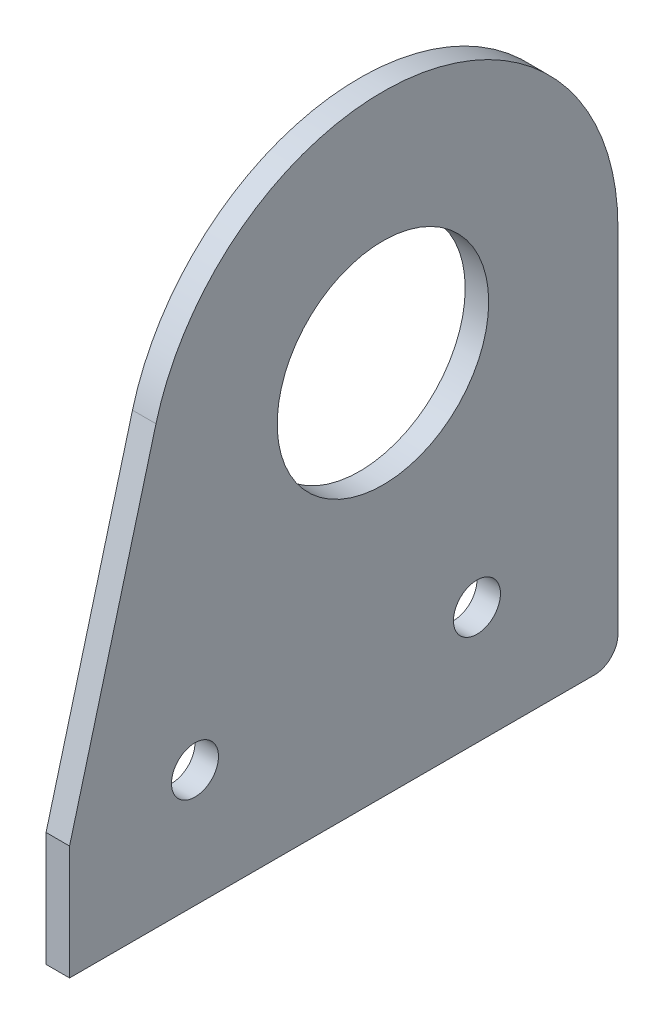
ISO-10303-21;
HEADER;
FILE_DESCRIPTION(('STEP AP214'),'2;1');
FILE_NAME('part.step','',(''),(''),'','','');
FILE_SCHEMA(('AUTOMOTIVE_DESIGN { 1 0 10303 214 1 1 1 1 }'));
ENDSEC;
DATA;
#1=APPLICATION_CONTEXT('core data for automotive mechanical design processes');
#2=APPLICATION_PROTOCOL_DEFINITION('international standard','automotive_design',2000,#1);
#3=PRODUCT_CONTEXT('',#1,'mechanical');
#4=PRODUCT('Part','Part','',(#3));
#5=PRODUCT_RELATED_PRODUCT_CATEGORY('part','',(#4));
#6=PRODUCT_DEFINITION_FORMATION('','',#4);
#7=PRODUCT_DEFINITION_CONTEXT('part definition',#1,'design');
#8=PRODUCT_DEFINITION('design','',#6,#7);
#9=PRODUCT_DEFINITION_SHAPE('','',#8);
#10=(LENGTH_UNIT() NAMED_UNIT(*) SI_UNIT(.MILLI.,.METRE.));
#11=(NAMED_UNIT(*) PLANE_ANGLE_UNIT() SI_UNIT($,.RADIAN.));
#12=(NAMED_UNIT(*) SI_UNIT($,.STERADIAN.) SOLID_ANGLE_UNIT());
#13=UNCERTAINTY_MEASURE_WITH_UNIT(LENGTH_MEASURE(1.E-05),#10,'distance_accuracy_value','');
#14=(GEOMETRIC_REPRESENTATION_CONTEXT(3) GLOBAL_UNCERTAINTY_ASSIGNED_CONTEXT((#13)) GLOBAL_UNIT_ASSIGNED_CONTEXT((#10,
#11,#12)) REPRESENTATION_CONTEXT('',''));
#15=CARTESIAN_POINT('',(0.,0.,0.));
#16=DIRECTION('',(0.,0.,1.));
#17=DIRECTION('',(1.,0.,0.));
#18=AXIS2_PLACEMENT_3D('',#15,#16,#17);
#19=CARTESIAN_POINT('',(3.175,146.05,0.));
#20=DIRECTION('',(1.,0.,0.));
#21=DIRECTION('',(0.,0.,-1.));
#22=AXIS2_PLACEMENT_3D('',#19,#20,#21);
#23=PLANE('',#22);
#24=CARTESIAN_POINT('',(3.175,111.125,25.4));
#25=DIRECTION('',(1.,0.,0.));
#26=DIRECTION('',(0.,0.,-1.));
#27=AXIS2_PLACEMENT_3D('',#24,#25,#26);
#28=CIRCLE('',#27,3.175);
#29=CARTESIAN_POINT('',(3.175,111.125,22.225));
#30=VERTEX_POINT('',#29);
#31=EDGE_CURVE('E181',#30,#30,#28,.T.);
#32=ORIENTED_EDGE('',*,*,#31,.F.);
#33=EDGE_LOOP('',(#32));
#34=FACE_BOUND('',#33,.T.);
#35=CARTESIAN_POINT('',(3.175,146.05,0.));
#36=DIRECTION('',(1.,0.,0.));
#37=DIRECTION('',(0.,0.,-1.));
#38=AXIS2_PLACEMENT_3D('',#35,#36,#37);
#39=CIRCLE('',#38,31.75);
#40=CARTESIAN_POINT('',(3.175,146.05,-31.75));
#41=VERTEX_POINT('',#40);
#42=CARTESIAN_POINT('',(3.175,154.267504682005,30.6681449846779));
#43=VERTEX_POINT('',#42);
#44=EDGE_CURVE('E154',#41,#43,#39,.T.);
#45=ORIENTED_EDGE('',*,*,#44,.T.);
#46=DIRECTION('',(0.,-0.965925826289067,0.258819045102525));
#47=VECTOR('',#46,1.);
#48=CARTESIAN_POINT('',(3.175,154.267504682005,30.6681449846779));
#49=LINE('',#48,#47);
#50=CARTESIAN_POINT('',(3.175,110.692257993871,42.3440971447506));
#51=VERTEX_POINT('',#50);
#52=EDGE_CURVE('E98',#43,#51,#49,.T.);
#53=ORIENTED_EDGE('',*,*,#52,.T.);
#54=DIRECTION('',(0.,-1.,0.));
#55=VECTOR('',#54,1.);
#56=CARTESIAN_POINT('',(3.175,95.25,42.3440971447506));
#57=LINE('',#56,#55);
#58=CARTESIAN_POINT('',(3.175,95.25,42.3440971447506));
#59=VERTEX_POINT('',#58);
#60=EDGE_CURVE('E112',#51,#59,#57,.T.);
#61=ORIENTED_EDGE('',*,*,#60,.T.);
#62=DIRECTION('',(0.,0.,-1.));
#63=VECTOR('',#62,1.);
#64=CARTESIAN_POINT('',(3.175,95.25,42.3440971447506));
#65=LINE('',#64,#63);
#66=CARTESIAN_POINT('',(3.175,95.25,-28.575));
#67=VERTEX_POINT('',#66);
#68=EDGE_CURVE('E105',#59,#67,#65,.T.);
#69=ORIENTED_EDGE('',*,*,#68,.T.);
#70=CARTESIAN_POINT('',(3.175,98.425,-28.575));
#71=DIRECTION('',(1.,0.,0.));
#72=DIRECTION('',(0.,0.,-1.));
#73=AXIS2_PLACEMENT_3D('',#70,#71,#72);
#74=CIRCLE('',#73,3.175);
#75=CARTESIAN_POINT('',(3.175,98.425,-31.75));
#76=VERTEX_POINT('',#75);
#77=EDGE_CURVE('E109',#67,#76,#74,.T.);
#78=ORIENTED_EDGE('',*,*,#77,.T.);
#79=DIRECTION('',(0.,1.,0.));
#80=VECTOR('',#79,1.);
#81=CARTESIAN_POINT('',(3.175,110.608066701445,-31.75));
#82=LINE('',#81,#80);
#83=EDGE_CURVE('E63',#76,#41,#82,.T.);
#84=ORIENTED_EDGE('',*,*,#83,.T.);
#85=EDGE_LOOP('',(#45,#53,#61,#69,#78,#84));
#86=FACE_BOUND('',#85,.T.);
#87=CARTESIAN_POINT('',(3.175,146.05,0.));
#88=DIRECTION('',(1.,0.,0.));
#89=DIRECTION('',(0.,0.,-1.));
#90=AXIS2_PLACEMENT_3D('',#87,#88,#89);
#91=CIRCLE('',#90,14.2875);
#92=CARTESIAN_POINT('',(3.175,146.05,-14.2875));
#93=VERTEX_POINT('',#92);
#94=EDGE_CURVE('E141',#93,#93,#91,.T.);
#95=ORIENTED_EDGE('',*,*,#94,.F.);
#96=EDGE_LOOP('',(#95));
#97=FACE_BOUND('',#96,.T.);
#98=CARTESIAN_POINT('',(3.175,111.125,-12.7));
#99=DIRECTION('',(1.,0.,0.));
#100=DIRECTION('',(0.,0.,-1.));
#101=AXIS2_PLACEMENT_3D('',#98,#99,#100);
#102=CIRCLE('',#101,3.175);
#103=CARTESIAN_POINT('',(3.175,111.125,-15.875));
#104=VERTEX_POINT('',#103);
#105=EDGE_CURVE('E189',#104,#104,#102,.T.);
#106=ORIENTED_EDGE('',*,*,#105,.F.);
#107=EDGE_LOOP('',(#106));
#108=FACE_BOUND('',#107,.T.);
#109=ADVANCED_FACE('F45',(#34,#86,#97,#108),#23,.T.);
#110=CARTESIAN_POINT('',(0.,146.05,0.));
#111=DIRECTION('',(1.,0.,0.));
#112=DIRECTION('',(0.,0.,-1.));
#113=AXIS2_PLACEMENT_3D('',#110,#111,#112);
#114=PLANE('',#113);
#115=CARTESIAN_POINT('',(0.,146.05,0.));
#116=DIRECTION('',(1.,0.,0.));
#117=DIRECTION('',(0.,0.,-1.));
#118=AXIS2_PLACEMENT_3D('',#115,#116,#117);
#119=CIRCLE('',#118,31.75);
#120=CARTESIAN_POINT('',(0.,146.05,-31.75));
#121=VERTEX_POINT('',#120);
#122=CARTESIAN_POINT('',(0.,154.267504682005,30.6681449846779));
#123=VERTEX_POINT('',#122);
#124=EDGE_CURVE('E136',#121,#123,#119,.T.);
#125=ORIENTED_EDGE('',*,*,#124,.F.);
#126=DIRECTION('',(0.,1.,0.));
#127=VECTOR('',#126,1.);
#128=CARTESIAN_POINT('',(0.,146.05,-31.75));
#129=LINE('',#128,#127);
#130=CARTESIAN_POINT('',(0.,98.425,-31.75));
#131=VERTEX_POINT('',#130);
#132=EDGE_CURVE('E86',#131,#121,#129,.T.);
#133=ORIENTED_EDGE('',*,*,#132,.F.);
#134=CARTESIAN_POINT('',(0.,98.425,-28.575));
#135=DIRECTION('',(1.,0.,0.));
#136=DIRECTION('',(0.,0.,-1.));
#137=AXIS2_PLACEMENT_3D('',#134,#135,#136);
#138=CIRCLE('',#137,3.175);
#139=CARTESIAN_POINT('',(0.,95.25,-28.575));
#140=VERTEX_POINT('',#139);
#141=EDGE_CURVE('E149',#140,#131,#138,.T.);
#142=ORIENTED_EDGE('',*,*,#141,.F.);
#143=DIRECTION('',(0.,0.,-1.));
#144=VECTOR('',#143,1.);
#145=CARTESIAN_POINT('',(0.,95.25,42.3440971447506));
#146=LINE('',#145,#144);
#147=CARTESIAN_POINT('',(0.,95.25,42.3440971447506));
#148=VERTEX_POINT('',#147);
#149=EDGE_CURVE('E122',#148,#140,#146,.T.);
#150=ORIENTED_EDGE('',*,*,#149,.F.);
#151=DIRECTION('',(0.,-1.,0.));
#152=VECTOR('',#151,1.);
#153=CARTESIAN_POINT('',(0.,95.25,42.3440971447506));
#154=LINE('',#153,#152);
#155=CARTESIAN_POINT('',(0.,110.692257993871,42.3440971447506));
#156=VERTEX_POINT('',#155);
#157=EDGE_CURVE('E144',#156,#148,#154,.T.);
#158=ORIENTED_EDGE('',*,*,#157,.F.);
#159=DIRECTION('',(0.,-0.965925826289067,0.258819045102525));
#160=VECTOR('',#159,1.);
#161=CARTESIAN_POINT('',(0.,154.267504682005,30.6681449846779));
#162=LINE('',#161,#160);
#163=EDGE_CURVE('E140',#123,#156,#162,.T.);
#164=ORIENTED_EDGE('',*,*,#163,.F.);
#165=EDGE_LOOP('',(#125,#133,#142,#150,#158,#164));
#166=FACE_BOUND('',#165,.T.);
#167=CARTESIAN_POINT('',(0.,146.05,0.));
#168=DIRECTION('',(1.,0.,0.));
#169=DIRECTION('',(0.,0.,-1.));
#170=AXIS2_PLACEMENT_3D('',#167,#168,#169);
#171=CIRCLE('',#170,14.2875);
#172=CARTESIAN_POINT('',(0.,146.05,-14.2875));
#173=VERTEX_POINT('',#172);
#174=EDGE_CURVE('E176',#173,#173,#171,.T.);
#175=ORIENTED_EDGE('',*,*,#174,.T.);
#176=EDGE_LOOP('',(#175));
#177=FACE_BOUND('',#176,.T.);
#178=CARTESIAN_POINT('',(0.,111.125,25.4));
#179=DIRECTION('',(1.,0.,0.));
#180=DIRECTION('',(0.,0.,-1.));
#181=AXIS2_PLACEMENT_3D('',#178,#179,#180);
#182=CIRCLE('',#181,3.175);
#183=CARTESIAN_POINT('',(0.,111.125,22.225));
#184=VERTEX_POINT('',#183);
#185=EDGE_CURVE('E185',#184,#184,#182,.T.);
#186=ORIENTED_EDGE('',*,*,#185,.T.);
#187=EDGE_LOOP('',(#186));
#188=FACE_BOUND('',#187,.T.);
#189=CARTESIAN_POINT('',(0.,111.125,-12.7));
#190=DIRECTION('',(1.,0.,0.));
#191=DIRECTION('',(0.,0.,-1.));
#192=AXIS2_PLACEMENT_3D('',#189,#190,#191);
#193=CIRCLE('',#192,3.175);
#194=CARTESIAN_POINT('',(0.,111.125,-15.875));
#195=VERTEX_POINT('',#194);
#196=EDGE_CURVE('E193',#195,#195,#193,.T.);
#197=ORIENTED_EDGE('',*,*,#196,.T.);
#198=EDGE_LOOP('',(#197));
#199=FACE_BOUND('',#198,.T.);
#200=ADVANCED_FACE('F165',(#166,#177,#188,#199),#114,.F.);
#201=CARTESIAN_POINT('',(3.175,146.05,0.));
#202=DIRECTION('',(-1.,0.,0.));
#203=DIRECTION('',(0.,0.,1.));
#204=AXIS2_PLACEMENT_3D('',#201,#202,#203);
#205=CYLINDRICAL_SURFACE('',#204,31.75);
#206=ORIENTED_EDGE('',*,*,#124,.T.);
#207=DIRECTION('',(-1.,0.,0.));
#208=VECTOR('',#207,1.);
#209=CARTESIAN_POINT('',(3.175,154.267504682005,30.6681449846779));
#210=LINE('',#209,#208);
#211=EDGE_CURVE('E11',#43,#123,#210,.T.);
#212=ORIENTED_EDGE('',*,*,#211,.F.);
#213=ORIENTED_EDGE('',*,*,#44,.F.);
#214=DIRECTION('',(-1.,0.,0.));
#215=VECTOR('',#214,1.);
#216=CARTESIAN_POINT('',(3.175,146.05,-31.75));
#217=LINE('',#216,#215);
#218=EDGE_CURVE('E132',#41,#121,#217,.T.);
#219=ORIENTED_EDGE('',*,*,#218,.T.);
#220=EDGE_LOOP('',(#206,#212,#213,#219));
#221=FACE_BOUND('',#220,.T.);
#222=ADVANCED_FACE('F47',(#221),#205,.T.);
#223=CARTESIAN_POINT('',(3.175,154.267504682005,30.6681449846779));
#224=DIRECTION('',(0.,-0.258819045102525,-0.965925826289067));
#225=DIRECTION('',(0.,0.965925826289067,-0.258819045102525));
#226=AXIS2_PLACEMENT_3D('',#223,#224,#225);
#227=PLANE('',#226);
#228=ORIENTED_EDGE('',*,*,#163,.T.);
#229=DIRECTION('',(-1.,0.,0.));
#230=VECTOR('',#229,1.);
#231=CARTESIAN_POINT('',(3.175,110.692257993871,42.3440971447506));
#232=LINE('',#231,#230);
#233=EDGE_CURVE('E55',#51,#156,#232,.T.);
#234=ORIENTED_EDGE('',*,*,#233,.F.);
#235=ORIENTED_EDGE('',*,*,#52,.F.);
#236=ORIENTED_EDGE('',*,*,#211,.T.);
#237=EDGE_LOOP('',(#228,#234,#235,#236));
#238=FACE_BOUND('',#237,.T.);
#239=ADVANCED_FACE('F223',(#238),#227,.F.);
#240=CARTESIAN_POINT('',(3.175,95.25,42.3440971447506));
#241=DIRECTION('',(0.,0.,-1.));
#242=DIRECTION('',(0.,1.,0.));
#243=AXIS2_PLACEMENT_3D('',#240,#241,#242);
#244=PLANE('',#243);
#245=ORIENTED_EDGE('',*,*,#157,.T.);
#246=DIRECTION('',(-1.,0.,0.));
#247=VECTOR('',#246,1.);
#248=CARTESIAN_POINT('',(3.175,95.25,42.3440971447506));
#249=LINE('',#248,#247);
#250=EDGE_CURVE('E125',#59,#148,#249,.T.);
#251=ORIENTED_EDGE('',*,*,#250,.F.);
#252=ORIENTED_EDGE('',*,*,#60,.F.);
#253=ORIENTED_EDGE('',*,*,#233,.T.);
#254=EDGE_LOOP('',(#245,#251,#252,#253));
#255=FACE_BOUND('',#254,.T.);
#256=ADVANCED_FACE('F164',(#255),#244,.F.);
#257=CARTESIAN_POINT('',(3.175,95.25,42.3440971447506));
#258=DIRECTION('',(0.,1.,0.));
#259=DIRECTION('',(0.,0.,1.));
#260=AXIS2_PLACEMENT_3D('',#257,#258,#259);
#261=PLANE('',#260);
#262=ORIENTED_EDGE('',*,*,#149,.T.);
#263=DIRECTION('',(-1.,0.,0.));
#264=VECTOR('',#263,1.);
#265=CARTESIAN_POINT('',(3.175,95.25,-28.575));
#266=LINE('',#265,#264);
#267=EDGE_CURVE('E119',#67,#140,#266,.T.);
#268=ORIENTED_EDGE('',*,*,#267,.F.);
#269=ORIENTED_EDGE('',*,*,#68,.F.);
#270=ORIENTED_EDGE('',*,*,#250,.T.);
#271=EDGE_LOOP('',(#262,#268,#269,#270));
#272=FACE_BOUND('',#271,.T.);
#273=ADVANCED_FACE('F120',(#272),#261,.F.);
#274=CARTESIAN_POINT('',(3.175,98.425,-28.575));
#275=DIRECTION('',(-1.,0.,0.));
#276=DIRECTION('',(0.,0.,1.));
#277=AXIS2_PLACEMENT_3D('',#274,#275,#276);
#278=CYLINDRICAL_SURFACE('',#277,3.175);
#279=ORIENTED_EDGE('',*,*,#141,.T.);
#280=DIRECTION('',(-1.,0.,0.));
#281=VECTOR('',#280,1.);
#282=CARTESIAN_POINT('',(3.175,98.425,-31.75));
#283=LINE('',#282,#281);
#284=EDGE_CURVE('E126',#76,#131,#283,.T.);
#285=ORIENTED_EDGE('',*,*,#284,.F.);
#286=ORIENTED_EDGE('',*,*,#77,.F.);
#287=ORIENTED_EDGE('',*,*,#267,.T.);
#288=EDGE_LOOP('',(#279,#285,#286,#287));
#289=FACE_BOUND('',#288,.T.);
#290=ADVANCED_FACE('F128',(#289),#278,.T.);
#291=CARTESIAN_POINT('',(3.175,146.05,-31.75));
#292=DIRECTION('',(0.,0.,1.));
#293=DIRECTION('',(0.,-1.,0.));
#294=AXIS2_PLACEMENT_3D('',#291,#292,#293);
#295=PLANE('',#294);
#296=ORIENTED_EDGE('',*,*,#132,.T.);
#297=ORIENTED_EDGE('',*,*,#218,.F.);
#298=ORIENTED_EDGE('',*,*,#83,.F.);
#299=ORIENTED_EDGE('',*,*,#284,.T.);
#300=EDGE_LOOP('',(#296,#297,#298,#299));
#301=FACE_BOUND('',#300,.T.);
#302=ADVANCED_FACE('F167',(#301),#295,.F.);
#303=CARTESIAN_POINT('',(3.175,146.05,0.));
#304=DIRECTION('',(-1.,0.,0.));
#305=DIRECTION('',(0.,0.,1.));
#306=AXIS2_PLACEMENT_3D('',#303,#304,#305);
#307=CYLINDRICAL_SURFACE('',#306,14.2875);
#308=ORIENTED_EDGE('',*,*,#94,.T.);
#309=EDGE_LOOP('',(#308));
#310=FACE_BOUND('',#309,.T.);
#311=ORIENTED_EDGE('',*,*,#174,.F.);
#312=EDGE_LOOP('',(#311));
#313=FACE_BOUND('',#312,.T.);
#314=ADVANCED_FACE('F213',(#310,#313),#307,.F.);
#315=CARTESIAN_POINT('',(3.175,111.125,25.4));
#316=DIRECTION('',(-1.,0.,0.));
#317=DIRECTION('',(0.,0.,1.));
#318=AXIS2_PLACEMENT_3D('',#315,#316,#317);
#319=CYLINDRICAL_SURFACE('',#318,3.175);
#320=ORIENTED_EDGE('',*,*,#31,.T.);
#321=EDGE_LOOP('',(#320));
#322=FACE_BOUND('',#321,.T.);
#323=ORIENTED_EDGE('',*,*,#185,.F.);
#324=EDGE_LOOP('',(#323));
#325=FACE_BOUND('',#324,.T.);
#326=ADVANCED_FACE('F296',(#322,#325),#319,.F.);
#327=CARTESIAN_POINT('',(3.175,111.125,-12.7));
#328=DIRECTION('',(-1.,0.,0.));
#329=DIRECTION('',(0.,0.,1.));
#330=AXIS2_PLACEMENT_3D('',#327,#328,#329);
#331=CYLINDRICAL_SURFACE('',#330,3.175);
#332=ORIENTED_EDGE('',*,*,#105,.T.);
#333=EDGE_LOOP('',(#332));
#334=FACE_BOUND('',#333,.T.);
#335=ORIENTED_EDGE('',*,*,#196,.F.);
#336=EDGE_LOOP('',(#335));
#337=FACE_BOUND('',#336,.T.);
#338=ADVANCED_FACE('F201',(#334,#337),#331,.F.);
#339=CLOSED_SHELL('',(#109,#200,#222,#239,#256,#273,#290,#302,#314,#326,#338));
#340=MANIFOLD_SOLID_BREP('B2',#339);
#341=ADVANCED_BREP_SHAPE_REPRESENTATION('',(#18,#340),#14);
#342=SHAPE_DEFINITION_REPRESENTATION(#9,#341);
ENDSEC;
END-ISO-10303-21;
